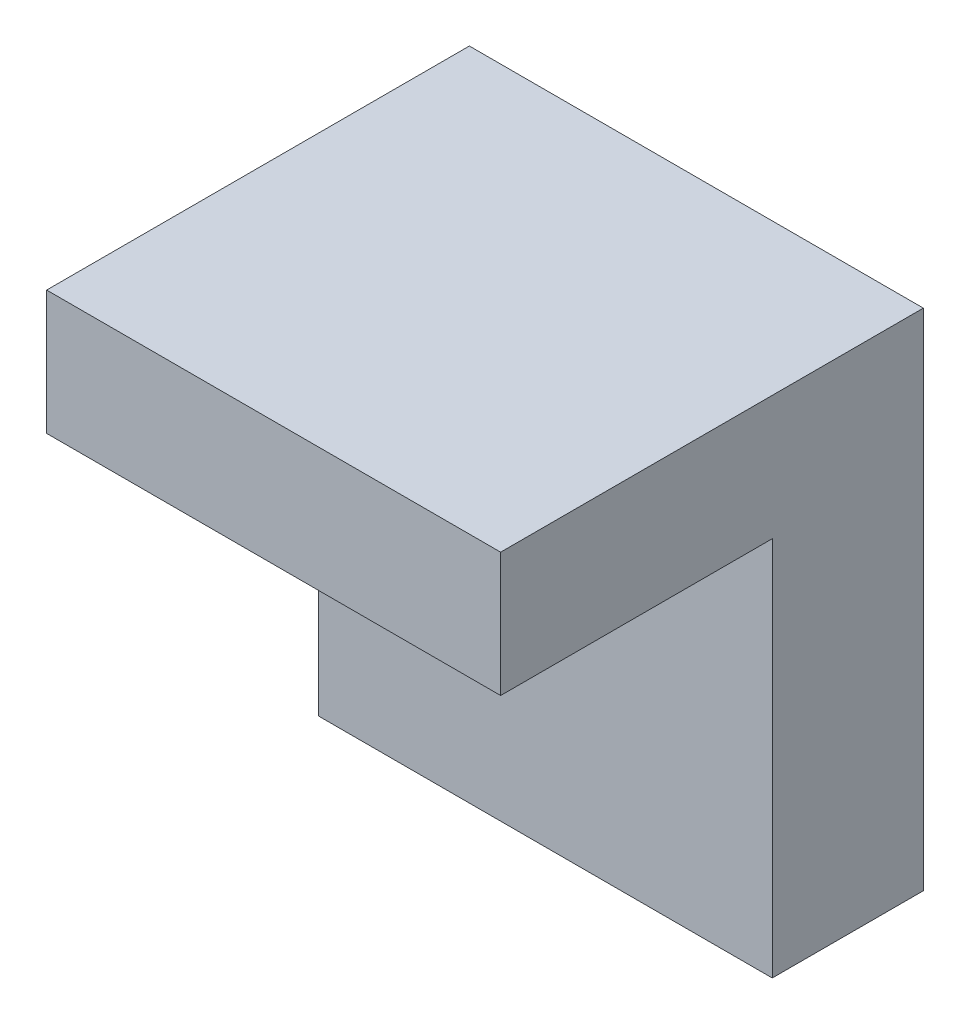
ISO-10303-21;
HEADER;
FILE_DESCRIPTION(('STEP AP214'),'2;1');
FILE_NAME('part.step','',(''),(''),'','','');
FILE_SCHEMA(('AUTOMOTIVE_DESIGN { 1 0 10303 214 1 1 1 1 }'));
ENDSEC;
DATA;
#1=APPLICATION_CONTEXT('core data for automotive mechanical design processes');
#2=APPLICATION_PROTOCOL_DEFINITION('international standard','automotive_design',2000,#1);
#3=PRODUCT_CONTEXT('',#1,'mechanical');
#4=PRODUCT('Part','Part','',(#3));
#5=PRODUCT_RELATED_PRODUCT_CATEGORY('part','',(#4));
#6=PRODUCT_DEFINITION_FORMATION('','',#4);
#7=PRODUCT_DEFINITION_CONTEXT('part definition',#1,'design');
#8=PRODUCT_DEFINITION('design','',#6,#7);
#9=PRODUCT_DEFINITION_SHAPE('','',#8);
#10=(LENGTH_UNIT() NAMED_UNIT(*) SI_UNIT(.MILLI.,.METRE.));
#11=(NAMED_UNIT(*) PLANE_ANGLE_UNIT() SI_UNIT($,.RADIAN.));
#12=(NAMED_UNIT(*) SI_UNIT($,.STERADIAN.) SOLID_ANGLE_UNIT());
#13=UNCERTAINTY_MEASURE_WITH_UNIT(LENGTH_MEASURE(1.E-05),#10,'distance_accuracy_value','');
#14=(GEOMETRIC_REPRESENTATION_CONTEXT(3) GLOBAL_UNCERTAINTY_ASSIGNED_CONTEXT((#13)) GLOBAL_UNIT_ASSIGNED_CONTEXT((#10,
#11,#12)) REPRESENTATION_CONTEXT('',''));
#15=CARTESIAN_POINT('',(0.,0.,0.));
#16=DIRECTION('',(0.,0.,1.));
#17=DIRECTION('',(1.,0.,0.));
#18=AXIS2_PLACEMENT_3D('',#15,#16,#17);
#19=CARTESIAN_POINT('',(11.7,0.,3.5));
#20=DIRECTION('',(0.,0.,1.));
#21=DIRECTION('',(1.,0.,0.));
#22=AXIS2_PLACEMENT_3D('',#19,#20,#21);
#23=PLANE('',#22);
#24=DIRECTION('',(0.,1.,0.));
#25=VECTOR('',#24,1.);
#26=CARTESIAN_POINT('',(0.,0.,3.5));
#27=LINE('',#26,#25);
#28=CARTESIAN_POINT('',(0.,-1.6,3.5));
#29=VERTEX_POINT('',#28);
#30=CARTESIAN_POINT('',(0.,1.6,3.5));
#31=VERTEX_POINT('',#30);
#32=EDGE_CURVE('E120',#29,#31,#27,.T.);
#33=ORIENTED_EDGE('',*,*,#32,.F.);
#34=DIRECTION('',(-1.,0.,0.));
#35=VECTOR('',#34,1.);
#36=CARTESIAN_POINT('',(11.7,-1.6,3.5));
#37=LINE('',#36,#35);
#38=CARTESIAN_POINT('',(11.7,-1.6,3.5));
#39=VERTEX_POINT('',#38);
#40=EDGE_CURVE('E11',#39,#29,#37,.T.);
#41=ORIENTED_EDGE('',*,*,#40,.F.);
#42=DIRECTION('',(0.,1.,0.));
#43=VECTOR('',#42,1.);
#44=CARTESIAN_POINT('',(11.7,0.,3.5));
#45=LINE('',#44,#43);
#46=CARTESIAN_POINT('',(11.7,1.6,3.5));
#47=VERTEX_POINT('',#46);
#48=EDGE_CURVE('E134',#39,#47,#45,.T.);
#49=ORIENTED_EDGE('',*,*,#48,.T.);
#50=DIRECTION('',(-1.,0.,0.));
#51=VECTOR('',#50,1.);
#52=CARTESIAN_POINT('',(11.7,1.6,3.5));
#53=LINE('',#52,#51);
#54=EDGE_CURVE('E83',#47,#31,#53,.T.);
#55=ORIENTED_EDGE('',*,*,#54,.T.);
#56=EDGE_LOOP('',(#33,#41,#49,#55));
#57=FACE_BOUND('',#56,.T.);
#58=ADVANCED_FACE('F39',(#57),#23,.T.);
#59=CARTESIAN_POINT('',(11.7,-1.6,0.));
#60=DIRECTION('',(0.,-1.,0.));
#61=DIRECTION('',(0.,0.,-1.));
#62=AXIS2_PLACEMENT_3D('',#59,#60,#61);
#63=PLANE('',#62);
#64=DIRECTION('',(0.,0.,1.));
#65=VECTOR('',#64,1.);
#66=CARTESIAN_POINT('',(0.,-1.6,0.));
#67=LINE('',#66,#65);
#68=CARTESIAN_POINT('',(0.,-1.6,-3.5));
#69=VERTEX_POINT('',#68);
#70=EDGE_CURVE('E123',#69,#29,#67,.T.);
#71=ORIENTED_EDGE('',*,*,#70,.F.);
#72=DIRECTION('',(-1.,0.,0.));
#73=VECTOR('',#72,1.);
#74=CARTESIAN_POINT('',(11.7,-1.6,-3.5));
#75=LINE('',#74,#73);
#76=CARTESIAN_POINT('',(11.7,-1.6,-3.5));
#77=VERTEX_POINT('',#76);
#78=EDGE_CURVE('E47',#77,#69,#75,.T.);
#79=ORIENTED_EDGE('',*,*,#78,.F.);
#80=DIRECTION('',(0.,0.,1.));
#81=VECTOR('',#80,1.);
#82=CARTESIAN_POINT('',(11.7,-1.6,0.));
#83=LINE('',#82,#81);
#84=EDGE_CURVE('E147',#77,#39,#83,.T.);
#85=ORIENTED_EDGE('',*,*,#84,.T.);
#86=ORIENTED_EDGE('',*,*,#40,.T.);
#87=EDGE_LOOP('',(#71,#79,#85,#86));
#88=FACE_BOUND('',#87,.T.);
#89=ADVANCED_FACE('F143',(#88),#63,.T.);
#90=CARTESIAN_POINT('',(11.7,0.,-3.5));
#91=DIRECTION('',(0.,0.,1.));
#92=DIRECTION('',(1.,0.,0.));
#93=AXIS2_PLACEMENT_3D('',#90,#91,#92);
#94=PLANE('',#93);
#95=DIRECTION('',(0.,1.,0.));
#96=VECTOR('',#95,1.);
#97=CARTESIAN_POINT('',(0.,0.,-3.5));
#98=LINE('',#97,#96);
#99=CARTESIAN_POINT('',(0.,-11.4042553191489,-3.5));
#100=VERTEX_POINT('',#99);
#101=EDGE_CURVE('E126',#100,#69,#98,.T.);
#102=ORIENTED_EDGE('',*,*,#101,.F.);
#103=DIRECTION('',(-1.,0.,0.));
#104=VECTOR('',#103,1.);
#105=CARTESIAN_POINT('',(11.7,-11.4042553191489,-3.5));
#106=LINE('',#105,#104);
#107=CARTESIAN_POINT('',(11.7,-11.4042553191489,-3.5));
#108=VERTEX_POINT('',#107);
#109=EDGE_CURVE('E113',#108,#100,#106,.T.);
#110=ORIENTED_EDGE('',*,*,#109,.F.);
#111=DIRECTION('',(0.,1.,0.));
#112=VECTOR('',#111,1.);
#113=CARTESIAN_POINT('',(11.7,0.,-3.5));
#114=LINE('',#113,#112);
#115=EDGE_CURVE('E102',#108,#77,#114,.T.);
#116=ORIENTED_EDGE('',*,*,#115,.T.);
#117=ORIENTED_EDGE('',*,*,#78,.T.);
#118=EDGE_LOOP('',(#102,#110,#116,#117));
#119=FACE_BOUND('',#118,.T.);
#120=ADVANCED_FACE('F140',(#119),#94,.T.);
#121=CARTESIAN_POINT('',(11.7,-11.4042553191489,0.));
#122=DIRECTION('',(0.,1.,0.));
#123=DIRECTION('',(0.,0.,1.));
#124=AXIS2_PLACEMENT_3D('',#121,#122,#123);
#125=PLANE('',#124);
#126=DIRECTION('',(0.,0.,-1.));
#127=VECTOR('',#126,1.);
#128=CARTESIAN_POINT('',(0.,-11.4042553191489,0.));
#129=LINE('',#128,#127);
#130=CARTESIAN_POINT('',(0.,-11.4042553191489,-7.39361702127658));
#131=VERTEX_POINT('',#130);
#132=EDGE_CURVE('E109',#100,#131,#129,.T.);
#133=ORIENTED_EDGE('',*,*,#132,.T.);
#134=DIRECTION('',(-1.,0.,0.));
#135=VECTOR('',#134,1.);
#136=CARTESIAN_POINT('',(11.7,-11.4042553191489,-7.39361702127658));
#137=LINE('',#136,#135);
#138=CARTESIAN_POINT('',(11.7,-11.4042553191489,-7.39361702127658));
#139=VERTEX_POINT('',#138);
#140=EDGE_CURVE('E106',#139,#131,#137,.T.);
#141=ORIENTED_EDGE('',*,*,#140,.F.);
#142=DIRECTION('',(0.,0.,-1.));
#143=VECTOR('',#142,1.);
#144=CARTESIAN_POINT('',(11.7,-11.4042553191489,0.));
#145=LINE('',#144,#143);
#146=EDGE_CURVE('E95',#108,#139,#145,.T.);
#147=ORIENTED_EDGE('',*,*,#146,.F.);
#148=ORIENTED_EDGE('',*,*,#109,.T.);
#149=EDGE_LOOP('',(#133,#141,#147,#148));
#150=FACE_BOUND('',#149,.T.);
#151=ADVANCED_FACE('F107',(#150),#125,.F.);
#152=CARTESIAN_POINT('',(11.7,0.,-7.39361702127658));
#153=DIRECTION('',(0.,0.,-1.));
#154=DIRECTION('',(0.,1.,0.));
#155=AXIS2_PLACEMENT_3D('',#152,#153,#154);
#156=PLANE('',#155);
#157=DIRECTION('',(0.,-1.,0.));
#158=VECTOR('',#157,1.);
#159=CARTESIAN_POINT('',(0.,0.,-7.39361702127658));
#160=LINE('',#159,#158);
#161=CARTESIAN_POINT('',(0.,1.6,-7.39361702127658));
#162=VERTEX_POINT('',#161);
#163=EDGE_CURVE('E130',#162,#131,#160,.T.);
#164=ORIENTED_EDGE('',*,*,#163,.F.);
#165=DIRECTION('',(-1.,0.,0.));
#166=VECTOR('',#165,1.);
#167=CARTESIAN_POINT('',(11.7,1.6,-7.39361702127658));
#168=LINE('',#167,#166);
#169=CARTESIAN_POINT('',(11.7,1.6,-7.39361702127658));
#170=VERTEX_POINT('',#169);
#171=EDGE_CURVE('E76',#170,#162,#168,.T.);
#172=ORIENTED_EDGE('',*,*,#171,.F.);
#173=DIRECTION('',(0.,-1.,0.));
#174=VECTOR('',#173,1.);
#175=CARTESIAN_POINT('',(11.7,0.,-7.39361702127658));
#176=LINE('',#175,#174);
#177=EDGE_CURVE('E99',#170,#139,#176,.T.);
#178=ORIENTED_EDGE('',*,*,#177,.T.);
#179=ORIENTED_EDGE('',*,*,#140,.T.);
#180=EDGE_LOOP('',(#164,#172,#178,#179));
#181=FACE_BOUND('',#180,.T.);
#182=ADVANCED_FACE('F115',(#181),#156,.T.);
#183=CARTESIAN_POINT('',(11.7,1.6,0.));
#184=DIRECTION('',(0.,-1.,0.));
#185=DIRECTION('',(0.,0.,-1.));
#186=AXIS2_PLACEMENT_3D('',#183,#184,#185);
#187=PLANE('',#186);
#188=DIRECTION('',(0.,0.,1.));
#189=VECTOR('',#188,1.);
#190=CARTESIAN_POINT('',(0.,1.6,0.));
#191=LINE('',#190,#189);
#192=EDGE_CURVE('E132',#162,#31,#191,.T.);
#193=ORIENTED_EDGE('',*,*,#192,.T.);
#194=ORIENTED_EDGE('',*,*,#54,.F.);
#195=DIRECTION('',(0.,0.,1.));
#196=VECTOR('',#195,1.);
#197=CARTESIAN_POINT('',(11.7,1.6,0.));
#198=LINE('',#197,#196);
#199=EDGE_CURVE('E55',#170,#47,#198,.T.);
#200=ORIENTED_EDGE('',*,*,#199,.F.);
#201=ORIENTED_EDGE('',*,*,#171,.T.);
#202=EDGE_LOOP('',(#193,#194,#200,#201));
#203=FACE_BOUND('',#202,.T.);
#204=ADVANCED_FACE('F146',(#203),#187,.F.);
#205=CARTESIAN_POINT('',(11.7,0.,0.));
#206=DIRECTION('',(1.,0.,0.));
#207=DIRECTION('',(0.,0.,-1.));
#208=AXIS2_PLACEMENT_3D('',#205,#206,#207);
#209=PLANE('',#208);
#210=ORIENTED_EDGE('',*,*,#48,.F.);
#211=ORIENTED_EDGE('',*,*,#84,.F.);
#212=ORIENTED_EDGE('',*,*,#115,.F.);
#213=ORIENTED_EDGE('',*,*,#146,.T.);
#214=ORIENTED_EDGE('',*,*,#177,.F.);
#215=ORIENTED_EDGE('',*,*,#199,.T.);
#216=EDGE_LOOP('',(#210,#211,#212,#213,#214,#215));
#217=FACE_BOUND('',#216,.T.);
#218=ADVANCED_FACE('F97',(#217),#209,.T.);
#219=CARTESIAN_POINT('',(0.,0.,0.));
#220=DIRECTION('',(1.,0.,0.));
#221=DIRECTION('',(0.,0.,-1.));
#222=AXIS2_PLACEMENT_3D('',#219,#220,#221);
#223=PLANE('',#222);
#224=ORIENTED_EDGE('',*,*,#32,.T.);
#225=ORIENTED_EDGE('',*,*,#192,.F.);
#226=ORIENTED_EDGE('',*,*,#163,.T.);
#227=ORIENTED_EDGE('',*,*,#132,.F.);
#228=ORIENTED_EDGE('',*,*,#101,.T.);
#229=ORIENTED_EDGE('',*,*,#70,.T.);
#230=EDGE_LOOP('',(#224,#225,#226,#227,#228,#229));
#231=FACE_BOUND('',#230,.T.);
#232=ADVANCED_FACE('F145',(#231),#223,.F.);
#233=CLOSED_SHELL('',(#58,#89,#120,#151,#182,#204,#218,#232));
#234=MANIFOLD_SOLID_BREP('B2',#233);
#235=ADVANCED_BREP_SHAPE_REPRESENTATION('',(#18,#234),#14);
#236=SHAPE_DEFINITION_REPRESENTATION(#9,#235);
ENDSEC;
END-ISO-10303-21;
